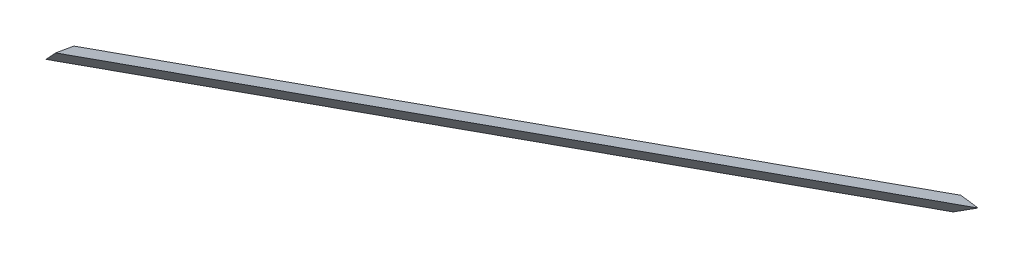
ISO-10303-21;
HEADER;
FILE_DESCRIPTION(('STEP AP214'),'2;1');
FILE_NAME('part.step','',(''),(''),'','','');
FILE_SCHEMA(('AUTOMOTIVE_DESIGN { 1 0 10303 214 1 1 1 1 }'));
ENDSEC;
DATA;
#1=APPLICATION_CONTEXT('core data for automotive mechanical design processes');
#2=APPLICATION_PROTOCOL_DEFINITION('international standard','automotive_design',2000,#1);
#3=PRODUCT_CONTEXT('',#1,'mechanical');
#4=PRODUCT('Part','Part','',(#3));
#5=PRODUCT_RELATED_PRODUCT_CATEGORY('part','',(#4));
#6=PRODUCT_DEFINITION_FORMATION('','',#4);
#7=PRODUCT_DEFINITION_CONTEXT('part definition',#1,'design');
#8=PRODUCT_DEFINITION('design','',#6,#7);
#9=PRODUCT_DEFINITION_SHAPE('','',#8);
#10=(LENGTH_UNIT() NAMED_UNIT(*) SI_UNIT(.MILLI.,.METRE.));
#11=(NAMED_UNIT(*) PLANE_ANGLE_UNIT() SI_UNIT($,.RADIAN.));
#12=(NAMED_UNIT(*) SI_UNIT($,.STERADIAN.) SOLID_ANGLE_UNIT());
#13=UNCERTAINTY_MEASURE_WITH_UNIT(LENGTH_MEASURE(1.E-05),#10,'distance_accuracy_value','');
#14=(GEOMETRIC_REPRESENTATION_CONTEXT(3) GLOBAL_UNCERTAINTY_ASSIGNED_CONTEXT((#13)) GLOBAL_UNIT_ASSIGNED_CONTEXT((#10,
#11,#12)) REPRESENTATION_CONTEXT('',''));
#15=CARTESIAN_POINT('',(0.,0.,0.));
#16=DIRECTION('',(0.,0.,1.));
#17=DIRECTION('',(1.,0.,0.));
#18=AXIS2_PLACEMENT_3D('',#15,#16,#17);
#19=CARTESIAN_POINT('',(-11.0804138166549,17.3620696147904,-14.0549311058847));
#20=DIRECTION('',(0.444370527755255,-0.696290965780646,0.563661001875038));
#21=DIRECTION('',(0.,-0.629196129232445,-0.777246570245832));
#22=AXIS2_PLACEMENT_3D('',#19,#20,#21);
#23=PLANE('',#22);
#24=DIRECTION('',(-0.467086179482794,0.356822089774961,0.809016994373293));
#25=VECTOR('',#24,1.);
#26=CARTESIAN_POINT('',(5150.38212535926,3342.84527697785,24.8019022629229));
#27=LINE('',#26,#25);
#28=CARTESIAN_POINT('',(5150.38212535775,3342.84527698021,24.8019022610085));
#29=VERTEX_POINT('',#28);
#30=CARTESIAN_POINT('',(4036.09562606042,4194.08441603373,1954.80273322669));
#31=VERTEX_POINT('',#30);
#32=EDGE_CURVE('E19',#29,#31,#27,.T.);
#33=ORIENTED_EDGE('',*,*,#32,.T.);
#34=DIRECTION('',(0.654469130781618,0.681969712719901,0.326477361828793));
#35=VECTOR('',#34,1.);
#36=CARTESIAN_POINT('',(4036.09562606043,4194.08441603373,1954.80273322669));
#37=LINE('',#36,#35);
#38=CARTESIAN_POINT('',(4103.09089205771,4263.89480151547,1988.22285446555));
#39=VERTEX_POINT('',#38);
#40=EDGE_CURVE('E80',#31,#39,#37,.T.);
#41=ORIENTED_EDGE('',*,*,#40,.T.);
#42=DIRECTION('',(0.467086179482769,-0.356822089774929,-0.809016994373321));
#43=VECTOR('',#42,1.);
#44=CARTESIAN_POINT('',(4103.09089205771,4263.89480151547,1988.22285446555));
#45=LINE('',#44,#43);
#46=CARTESIAN_POINT('',(5236.67250734865,3397.91550547658,24.8019022610084));
#47=VERTEX_POINT('',#46);
#48=EDGE_CURVE('E54',#39,#47,#45,.T.);
#49=ORIENTED_EDGE('',*,*,#48,.T.);
#50=DIRECTION('',(-0.842960923517792,-0.537974796270263,0.));
#51=VECTOR('',#50,1.);
#52=CARTESIAN_POINT('',(5236.67250735015,3397.91550547422,24.8019022629227));
#53=LINE('',#52,#51);
#54=EDGE_CURVE('E56',#47,#29,#53,.T.);
#55=ORIENTED_EDGE('',*,*,#54,.T.);
#56=EDGE_LOOP('',(#33,#41,#49,#55));
#57=FACE_BOUND('',#56,.T.);
#58=ADVANCED_FACE('F16',(#57),#23,.F.);
#59=CARTESIAN_POINT('',(4389.48457174591,4034.1125140652,754.999122524693));
#60=DIRECTION('',(0.730448811768304,0.671311778017372,0.125638489649576));
#61=DIRECTION('',(-0.676673678812601,0.736283051823292,0.));
#62=AXIS2_PLACEMENT_3D('',#59,#60,#61);
#63=PLANE('',#62);
#64=DIRECTION('',(0.186329447477902,-0.0189014194816006,-0.982305488808935));
#65=VECTOR('',#64,1.);
#66=CARTESIAN_POINT('',(4025.94516874079,4195.11408715832,2008.31467175259));
#67=LINE('',#66,#65);
#68=CARTESIAN_POINT('',(4025.94516874078,4195.11408715833,2008.31467175259));
#69=VERTEX_POINT('',#68);
#70=EDGE_CURVE('E67',#69,#31,#67,.T.);
#71=ORIENTED_EDGE('',*,*,#70,.T.);
#72=ORIENTED_EDGE('',*,*,#32,.F.);
#73=DIRECTION('',(0.643662317162788,-0.615155867938908,-0.455282417412488));
#74=VECTOR('',#73,1.);
#75=CARTESIAN_POINT('',(5150.38212535926,3342.84527697785,24.8019022629231));
#76=LINE('',#75,#74);
#77=CARTESIAN_POINT('',(5185.44618509466,3309.33413064405,-1.09365641542958E-11));
#78=VERTEX_POINT('',#77);
#79=EDGE_CURVE('E62',#29,#78,#76,.T.);
#80=ORIENTED_EDGE('',*,*,#79,.T.);
#81=DIRECTION('',(0.467086179481371,-0.356822089773106,-0.809016994374933));
#82=VECTOR('',#81,1.);
#83=CARTESIAN_POINT('',(4025.94516874078,4195.11408715833,2008.31467175258));
#84=LINE('',#83,#82);
#85=EDGE_CURVE('E82',#69,#78,#84,.T.);
#86=ORIENTED_EDGE('',*,*,#85,.F.);
#87=EDGE_LOOP('',(#71,#72,#80,#86));
#88=FACE_BOUND('',#87,.T.);
#89=ADVANCED_FACE('F64',(#88),#63,.F.);
#90=CARTESIAN_POINT('',(0.,0.,0.));
#91=DIRECTION('',(0.250607512160671,-0.392680737752119,0.884871579974796));
#92=DIRECTION('',(0.,-0.914039707413188,-0.405624719749689));
#93=AXIS2_PLACEMENT_3D('',#90,#91,#92);
#94=PLANE('',#93);
#95=ORIENTED_EDGE('',*,*,#79,.F.);
#96=ORIENTED_EDGE('',*,*,#54,.F.);
#97=DIRECTION('',(0.643662317162988,-0.615155867939267,-0.45528241741172));
#98=VECTOR('',#97,1.);
#99=CARTESIAN_POINT('',(5236.67250735015,3397.91550547422,24.8019022629232));
#100=LINE('',#99,#98);
#101=CARTESIAN_POINT('',(5271.73656708554,3364.40435914041,-2.11457475631109E-11));
#102=VERTEX_POINT('',#101);
#103=EDGE_CURVE('E74',#47,#102,#100,.T.);
#104=ORIENTED_EDGE('',*,*,#103,.T.);
#105=DIRECTION('',(0.842960923517802,0.537974796270247,0.));
#106=VECTOR('',#105,1.);
#107=CARTESIAN_POINT('',(5185.44618509467,3309.33413064404,0.));
#108=LINE('',#107,#106);
#109=EDGE_CURVE('E71',#78,#102,#108,.T.);
#110=ORIENTED_EDGE('',*,*,#109,.F.);
#111=EDGE_LOOP('',(#95,#96,#104,#110));
#112=FACE_BOUND('',#111,.T.);
#113=ADVANCED_FACE('F69',(#112),#94,.F.);
#114=CARTESIAN_POINT('',(4462.52945292275,4101.24369186694,767.562971489656));
#115=DIRECTION('',(-0.730448811768304,-0.671311778017372,-0.125638489649577));
#116=DIRECTION('',(0.676673678812601,-0.736283051823292,0.));
#117=AXIS2_PLACEMENT_3D('',#114,#115,#116);
#118=PLANE('',#117);
#119=ORIENTED_EDGE('',*,*,#103,.F.);
#120=ORIENTED_EDGE('',*,*,#48,.F.);
#121=DIRECTION('',(-0.186329447477932,0.0189014194815823,0.98230548880893));
#122=VECTOR('',#121,1.);
#123=CARTESIAN_POINT('',(4103.09089205771,4263.89480151547,1988.22285446555));
#124=LINE('',#123,#122);
#125=CARTESIAN_POINT('',(4092.94043473807,4264.92447264006,2041.73479299145));
#126=VERTEX_POINT('',#125);
#127=EDGE_CURVE('E34',#39,#126,#124,.T.);
#128=ORIENTED_EDGE('',*,*,#127,.T.);
#129=DIRECTION('',(-0.467086179481364,0.356822089773112,0.809016994374934));
#130=VECTOR('',#129,1.);
#131=CARTESIAN_POINT('',(5271.73656708554,3364.40435914039,-8.88178419700125E-13));
#132=LINE('',#131,#130);
#133=EDGE_CURVE('E25',#102,#126,#132,.T.);
#134=ORIENTED_EDGE('',*,*,#133,.F.);
#135=EDGE_LOOP('',(#119,#120,#128,#134));
#136=FACE_BOUND('',#135,.T.);
#137=ADVANCED_FACE('F88',(#136),#118,.F.);
#138=CARTESIAN_POINT('',(0.,0.,0.));
#139=DIRECTION('',(0.67911581020158,-0.720031948532649,0.142673436303081));
#140=DIRECTION('',(0.727474142160718,0.686135097839723,0.));
#141=AXIS2_PLACEMENT_3D('',#138,#139,#140);
#142=PLANE('',#141);
#143=ORIENTED_EDGE('',*,*,#70,.F.);
#144=DIRECTION('',(-0.654469130781609,-0.681969712719901,-0.326477361828813));
#145=VECTOR('',#144,1.);
#146=CARTESIAN_POINT('',(4092.94043473807,4264.92447264007,2041.73479299145));
#147=LINE('',#146,#145);
#148=EDGE_CURVE('E11',#126,#69,#147,.T.);
#149=ORIENTED_EDGE('',*,*,#148,.F.);
#150=ORIENTED_EDGE('',*,*,#127,.F.);
#151=ORIENTED_EDGE('',*,*,#40,.F.);
#152=EDGE_LOOP('',(#143,#149,#150,#151));
#153=FACE_BOUND('',#152,.T.);
#154=ADVANCED_FACE('F90',(#153),#142,.F.);
#155=CARTESIAN_POINT('',(0.,0.,0.));
#156=DIRECTION('',(0.444370527755255,-0.696290965780646,0.563661001875038));
#157=DIRECTION('',(0.,-0.629196129232445,-0.777246570245832));
#158=AXIS2_PLACEMENT_3D('',#155,#156,#157);
#159=PLANE('',#158);
#160=ORIENTED_EDGE('',*,*,#133,.T.);
#161=ORIENTED_EDGE('',*,*,#148,.T.);
#162=ORIENTED_EDGE('',*,*,#85,.T.);
#163=ORIENTED_EDGE('',*,*,#109,.T.);
#164=EDGE_LOOP('',(#160,#161,#162,#163));
#165=FACE_BOUND('',#164,.T.);
#166=ADVANCED_FACE('F87',(#165),#159,.T.);
#167=CLOSED_SHELL('',(#58,#89,#113,#137,#154,#166));
#168=MANIFOLD_SOLID_BREP('B1',#167);
#169=ADVANCED_BREP_SHAPE_REPRESENTATION('',(#18,#168),#14);
#170=SHAPE_DEFINITION_REPRESENTATION(#9,#169);
ENDSEC;
END-ISO-10303-21;
